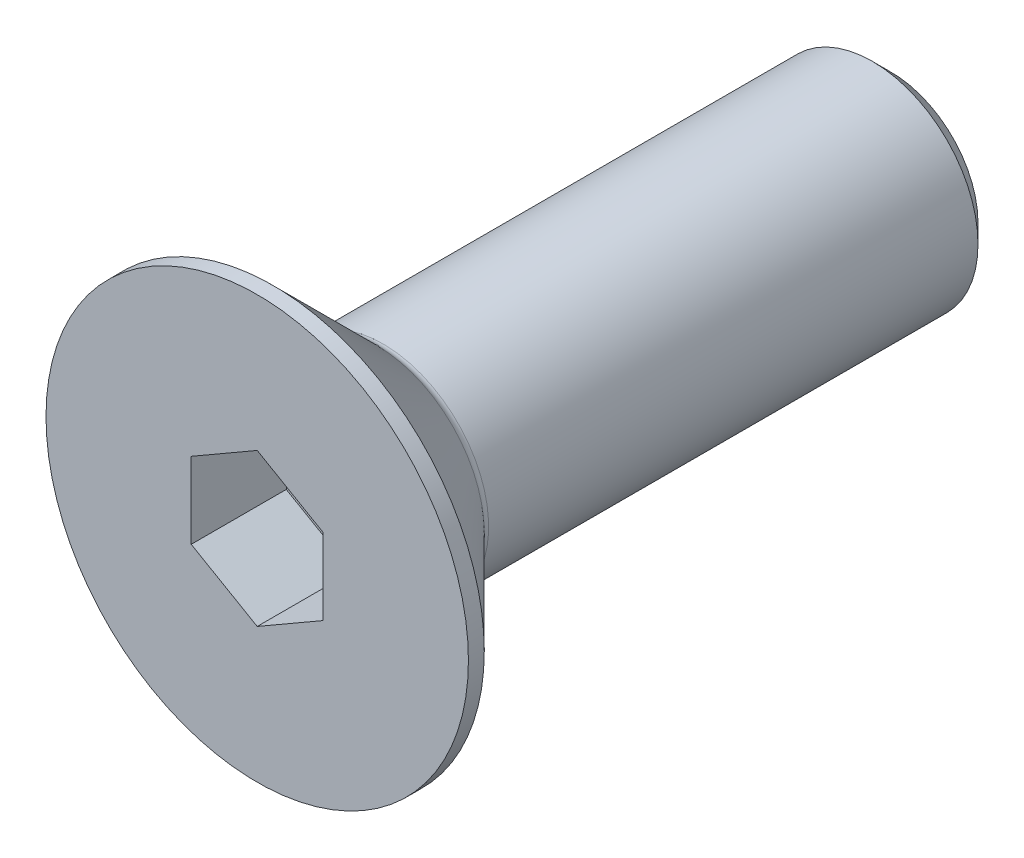
ISO-10303-21;
HEADER;
FILE_DESCRIPTION(('STEP AP214'),'2;1');
FILE_NAME('part.step','',(''),(''),'','','');
FILE_SCHEMA(('AUTOMOTIVE_DESIGN { 1 0 10303 214 1 1 1 1 }'));
ENDSEC;
DATA;
#1=APPLICATION_CONTEXT('core data for automotive mechanical design processes');
#2=APPLICATION_PROTOCOL_DEFINITION('international standard','automotive_design',2000,#1);
#3=PRODUCT_CONTEXT('',#1,'mechanical');
#4=PRODUCT('Part','Part','',(#3));
#5=PRODUCT_RELATED_PRODUCT_CATEGORY('part','',(#4));
#6=PRODUCT_DEFINITION_FORMATION('','',#4);
#7=PRODUCT_DEFINITION_CONTEXT('part definition',#1,'design');
#8=PRODUCT_DEFINITION('design','',#6,#7);
#9=PRODUCT_DEFINITION_SHAPE('','',#8);
#10=(LENGTH_UNIT() NAMED_UNIT(*) SI_UNIT(.MILLI.,.METRE.));
#11=(NAMED_UNIT(*) PLANE_ANGLE_UNIT() SI_UNIT($,.RADIAN.));
#12=(NAMED_UNIT(*) SI_UNIT($,.STERADIAN.) SOLID_ANGLE_UNIT());
#13=UNCERTAINTY_MEASURE_WITH_UNIT(LENGTH_MEASURE(1.E-05),#10,'distance_accuracy_value','');
#14=(GEOMETRIC_REPRESENTATION_CONTEXT(3) GLOBAL_UNCERTAINTY_ASSIGNED_CONTEXT((#13)) GLOBAL_UNIT_ASSIGNED_CONTEXT((#10,
#11,#12)) REPRESENTATION_CONTEXT('',''));
#15=CARTESIAN_POINT('',(0.,0.,0.));
#16=DIRECTION('',(0.,0.,1.));
#17=DIRECTION('',(1.,0.,0.));
#18=AXIS2_PLACEMENT_3D('',#15,#16,#17);
#19=CARTESIAN_POINT('',(0.,1.44337567297406,0.));
#20=DIRECTION('',(-0.5,0.866025403784439,0.));
#21=DIRECTION('',(-0.866025403784439,-0.5,0.));
#22=AXIS2_PLACEMENT_3D('',#19,#20,#21);
#23=PLANE('',#22);
#24=DIRECTION('',(0.,0.,1.));
#25=VECTOR('',#24,1.);
#26=CARTESIAN_POINT('',(0.,1.44337567297406,0.));
#27=LINE('',#26,#25);
#28=CARTESIAN_POINT('',(0.,1.44337567297406,-1.8));
#29=VERTEX_POINT('',#28);
#30=CARTESIAN_POINT('',(0.,1.44337567297406,0.));
#31=VERTEX_POINT('',#30);
#32=EDGE_CURVE('E82',#29,#31,#27,.T.);
#33=ORIENTED_EDGE('',*,*,#32,.T.);
#34=DIRECTION('',(-0.866025403784439,-0.5,0.));
#35=VECTOR('',#34,1.);
#36=CARTESIAN_POINT('',(0.,1.44337567297406,0.));
#37=LINE('',#36,#35);
#38=CARTESIAN_POINT('',(-1.25,0.721687836487033,0.));
#39=VERTEX_POINT('',#38);
#40=EDGE_CURVE('E71',#39,#31,#37,.F.);
#41=ORIENTED_EDGE('',*,*,#40,.F.);
#42=DIRECTION('',(0.,0.,1.));
#43=VECTOR('',#42,1.);
#44=CARTESIAN_POINT('',(-1.25,0.721687836487033,0.));
#45=LINE('',#44,#43);
#46=CARTESIAN_POINT('',(-1.25,0.721687836487033,-1.8));
#47=VERTEX_POINT('',#46);
#48=EDGE_CURVE('E138',#39,#47,#45,.F.);
#49=ORIENTED_EDGE('',*,*,#48,.T.);
#50=DIRECTION('',(-0.866025403784439,-0.5,0.));
#51=VECTOR('',#50,1.);
#52=CARTESIAN_POINT('',(0.,1.44337567297406,-1.8));
#53=LINE('',#52,#51);
#54=EDGE_CURVE('E67',#29,#47,#53,.T.);
#55=ORIENTED_EDGE('',*,*,#54,.F.);
#56=EDGE_LOOP('',(#33,#41,#49,#55));
#57=FACE_BOUND('',#56,.T.);
#58=ADVANCED_FACE('F16',(#57),#23,.F.);
#59=CARTESIAN_POINT('',(1.25,0.721687836487033,0.));
#60=DIRECTION('',(0.499999999999999,0.866025403784439,0.));
#61=DIRECTION('',(-0.866025403784439,0.499999999999999,0.));
#62=AXIS2_PLACEMENT_3D('',#59,#60,#61);
#63=PLANE('',#62);
#64=DIRECTION('',(0.,0.,-1.));
#65=VECTOR('',#64,1.);
#66=CARTESIAN_POINT('',(1.25,0.721687836487033,0.));
#67=LINE('',#66,#65);
#68=CARTESIAN_POINT('',(1.25,0.721687836487033,-1.8));
#69=VERTEX_POINT('',#68);
#70=CARTESIAN_POINT('',(1.25,0.721687836487033,0.));
#71=VERTEX_POINT('',#70);
#72=EDGE_CURVE('E87',#69,#71,#67,.F.);
#73=ORIENTED_EDGE('',*,*,#72,.T.);
#74=DIRECTION('',(-0.866025403784439,0.499999999999999,0.));
#75=VECTOR('',#74,1.);
#76=CARTESIAN_POINT('',(1.25,0.721687836487033,0.));
#77=LINE('',#76,#75);
#78=EDGE_CURVE('E75',#31,#71,#77,.F.);
#79=ORIENTED_EDGE('',*,*,#78,.F.);
#80=ORIENTED_EDGE('',*,*,#32,.F.);
#81=DIRECTION('',(-0.866025403784439,0.499999999999999,0.));
#82=VECTOR('',#81,1.);
#83=CARTESIAN_POINT('',(1.25,0.721687836487033,-1.8));
#84=LINE('',#83,#82);
#85=EDGE_CURVE('E88',#69,#29,#84,.T.);
#86=ORIENTED_EDGE('',*,*,#85,.F.);
#87=EDGE_LOOP('',(#73,#79,#80,#86));
#88=FACE_BOUND('',#87,.T.);
#89=ADVANCED_FACE('F85',(#88),#63,.F.);
#90=CARTESIAN_POINT('',(-1.25,0.721687836487033,0.));
#91=DIRECTION('',(-1.,0.,0.));
#92=DIRECTION('',(0.,0.,1.));
#93=AXIS2_PLACEMENT_3D('',#90,#91,#92);
#94=PLANE('',#93);
#95=ORIENTED_EDGE('',*,*,#48,.F.);
#96=DIRECTION('',(0.,1.,0.));
#97=VECTOR('',#96,1.);
#98=CARTESIAN_POINT('',(-1.25,0.721687836487033,0.));
#99=LINE('',#98,#97);
#100=CARTESIAN_POINT('',(-1.25,-0.721687836487033,0.));
#101=VERTEX_POINT('',#100);
#102=EDGE_CURVE('E78',#101,#39,#99,.T.);
#103=ORIENTED_EDGE('',*,*,#102,.F.);
#104=DIRECTION('',(0.,0.,1.));
#105=VECTOR('',#104,1.);
#106=CARTESIAN_POINT('',(-1.25,-0.721687836487033,0.));
#107=LINE('',#106,#105);
#108=CARTESIAN_POINT('',(-1.25,-0.721687836487033,-1.8));
#109=VERTEX_POINT('',#108);
#110=EDGE_CURVE('E129',#101,#109,#107,.F.);
#111=ORIENTED_EDGE('',*,*,#110,.T.);
#112=DIRECTION('',(0.,1.,0.));
#113=VECTOR('',#112,1.);
#114=CARTESIAN_POINT('',(-1.25,0.721687836487033,-1.8));
#115=LINE('',#114,#113);
#116=EDGE_CURVE('E136',#47,#109,#115,.F.);
#117=ORIENTED_EDGE('',*,*,#116,.F.);
#118=EDGE_LOOP('',(#95,#103,#111,#117));
#119=FACE_BOUND('',#118,.T.);
#120=ADVANCED_FACE('F141',(#119),#94,.F.);
#121=CARTESIAN_POINT('',(1.25,-0.721687836487033,0.));
#122=DIRECTION('',(1.,0.,0.));
#123=DIRECTION('',(0.,0.,-1.));
#124=AXIS2_PLACEMENT_3D('',#121,#122,#123);
#125=PLANE('',#124);
#126=DIRECTION('',(0.,0.,1.));
#127=VECTOR('',#126,1.);
#128=CARTESIAN_POINT('',(1.25,-0.721687836487032,0.));
#129=LINE('',#128,#127);
#130=CARTESIAN_POINT('',(1.25,-0.721687836487033,-1.8));
#131=VERTEX_POINT('',#130);
#132=CARTESIAN_POINT('',(1.25,-0.721687836487033,0.));
#133=VERTEX_POINT('',#132);
#134=EDGE_CURVE('E121',#131,#133,#129,.T.);
#135=ORIENTED_EDGE('',*,*,#134,.T.);
#136=DIRECTION('',(0.,1.,0.));
#137=VECTOR('',#136,1.);
#138=CARTESIAN_POINT('',(1.25,-0.721687836487033,0.));
#139=LINE('',#138,#137);
#140=EDGE_CURVE('E35',#71,#133,#139,.F.);
#141=ORIENTED_EDGE('',*,*,#140,.F.);
#142=ORIENTED_EDGE('',*,*,#72,.F.);
#143=DIRECTION('',(0.,1.,0.));
#144=VECTOR('',#143,1.);
#145=CARTESIAN_POINT('',(1.25,0.,-1.8));
#146=LINE('',#145,#144);
#147=EDGE_CURVE('E123',#131,#69,#146,.T.);
#148=ORIENTED_EDGE('',*,*,#147,.F.);
#149=EDGE_LOOP('',(#135,#141,#142,#148));
#150=FACE_BOUND('',#149,.T.);
#151=ADVANCED_FACE('F148',(#150),#125,.F.);
#152=CARTESIAN_POINT('',(-1.25,-0.721687836487033,0.));
#153=DIRECTION('',(-0.499999999999999,-0.866025403784439,0.));
#154=DIRECTION('',(0.866025403784439,-0.499999999999999,0.));
#155=AXIS2_PLACEMENT_3D('',#152,#153,#154);
#156=PLANE('',#155);
#157=ORIENTED_EDGE('',*,*,#110,.F.);
#158=DIRECTION('',(0.866025403784439,-0.499999999999999,0.));
#159=VECTOR('',#158,1.);
#160=CARTESIAN_POINT('',(-1.25,-0.721687836487033,0.));
#161=LINE('',#160,#159);
#162=CARTESIAN_POINT('',(0.,-1.44337567297406,0.));
#163=VERTEX_POINT('',#162);
#164=EDGE_CURVE('E132',#163,#101,#161,.F.);
#165=ORIENTED_EDGE('',*,*,#164,.F.);
#166=DIRECTION('',(0.,0.,1.));
#167=VECTOR('',#166,1.);
#168=CARTESIAN_POINT('',(0.,-1.44337567297406,0.));
#169=LINE('',#168,#167);
#170=CARTESIAN_POINT('',(0.,-1.44337567297406,-1.8));
#171=VERTEX_POINT('',#170);
#172=EDGE_CURVE('E119',#163,#171,#169,.F.);
#173=ORIENTED_EDGE('',*,*,#172,.T.);
#174=DIRECTION('',(0.866025403784439,-0.499999999999999,0.));
#175=VECTOR('',#174,1.);
#176=CARTESIAN_POINT('',(-1.25,-0.721687836487033,-1.8));
#177=LINE('',#176,#175);
#178=EDGE_CURVE('E126',#109,#171,#177,.T.);
#179=ORIENTED_EDGE('',*,*,#178,.F.);
#180=EDGE_LOOP('',(#157,#165,#173,#179));
#181=FACE_BOUND('',#180,.T.);
#182=ADVANCED_FACE('F155',(#181),#156,.F.);
#183=CARTESIAN_POINT('',(0.,0.,-1.8));
#184=DIRECTION('',(0.,0.,1.));
#185=DIRECTION('',(1.,0.,0.));
#186=AXIS2_PLACEMENT_3D('',#183,#184,#185);
#187=PLANE('',#186);
#188=ORIENTED_EDGE('',*,*,#54,.T.);
#189=ORIENTED_EDGE('',*,*,#116,.T.);
#190=ORIENTED_EDGE('',*,*,#178,.T.);
#191=DIRECTION('',(0.866025403784439,0.5,0.));
#192=VECTOR('',#191,1.);
#193=CARTESIAN_POINT('',(0.,-1.44337567297406,-1.8));
#194=LINE('',#193,#192);
#195=EDGE_CURVE('E116',#171,#131,#194,.T.);
#196=ORIENTED_EDGE('',*,*,#195,.T.);
#197=ORIENTED_EDGE('',*,*,#147,.T.);
#198=ORIENTED_EDGE('',*,*,#85,.T.);
#199=EDGE_LOOP('',(#188,#189,#190,#196,#197,#198));
#200=FACE_BOUND('',#199,.T.);
#201=ADVANCED_FACE('F145',(#200),#187,.T.);
#202=CARTESIAN_POINT('',(0.,-1.44337567297406,0.));
#203=DIRECTION('',(0.5,-0.866025403784439,0.));
#204=DIRECTION('',(0.866025403784439,0.5,0.));
#205=AXIS2_PLACEMENT_3D('',#202,#203,#204);
#206=PLANE('',#205);
#207=ORIENTED_EDGE('',*,*,#172,.F.);
#208=DIRECTION('',(-0.866025403784439,-0.499999999999999,0.));
#209=VECTOR('',#208,1.);
#210=CARTESIAN_POINT('',(1.25,-0.721687836487033,0.));
#211=LINE('',#210,#209);
#212=EDGE_CURVE('E114',#133,#163,#211,.T.);
#213=ORIENTED_EDGE('',*,*,#212,.F.);
#214=ORIENTED_EDGE('',*,*,#134,.F.);
#215=ORIENTED_EDGE('',*,*,#195,.F.);
#216=EDGE_LOOP('',(#207,#213,#214,#215));
#217=FACE_BOUND('',#216,.T.);
#218=ADVANCED_FACE('F153',(#217),#206,.F.);
#219=CARTESIAN_POINT('',(2.,0.,0.));
#220=DIRECTION('',(0.,0.,1.));
#221=DIRECTION('',(1.,0.,0.));
#222=AXIS2_PLACEMENT_3D('',#219,#220,#221);
#223=PLANE('',#222);
#224=ORIENTED_EDGE('',*,*,#140,.T.);
#225=ORIENTED_EDGE('',*,*,#212,.T.);
#226=ORIENTED_EDGE('',*,*,#164,.T.);
#227=ORIENTED_EDGE('',*,*,#102,.T.);
#228=ORIENTED_EDGE('',*,*,#40,.T.);
#229=ORIENTED_EDGE('',*,*,#78,.T.);
#230=EDGE_LOOP('',(#224,#225,#226,#227,#228,#229));
#231=FACE_BOUND('',#230,.T.);
#232=CARTESIAN_POINT('',(0.,0.,0.));
#233=DIRECTION('',(0.,0.,-1.));
#234=DIRECTION('',(-1.,0.,0.));
#235=AXIS2_PLACEMENT_3D('',#232,#233,#234);
#236=CIRCLE('',#235,4.);
#237=CARTESIAN_POINT('',(-4.,0.,0.));
#238=VERTEX_POINT('',#237);
#239=EDGE_CURVE('E20',#238,#238,#236,.T.);
#240=ORIENTED_EDGE('',*,*,#239,.F.);
#241=EDGE_LOOP('',(#240));
#242=FACE_BOUND('',#241,.T.);
#243=ADVANCED_FACE('F72',(#231,#242),#223,.T.);
#244=CARTESIAN_POINT('',(0.,0.,-0.150000000000001));
#245=DIRECTION('',(0.,0.,-1.));
#246=DIRECTION('',(-1.,0.,0.));
#247=AXIS2_PLACEMENT_3D('',#244,#245,#246);
#248=CYLINDRICAL_SURFACE('',#247,4.);
#249=ORIENTED_EDGE('',*,*,#239,.T.);
#250=EDGE_LOOP('',(#249));
#251=FACE_BOUND('',#250,.T.);
#252=CARTESIAN_POINT('',(0.,0.,-0.299999999128886));
#253=DIRECTION('',(0.,0.,1.));
#254=DIRECTION('',(1.,0.,0.));
#255=AXIS2_PLACEMENT_3D('',#252,#253,#254);
#256=CIRCLE('',#255,3.9999999991096);
#257=CARTESIAN_POINT('',(3.9999999991096,0.,-0.299999999128886));
#258=VERTEX_POINT('',#257);
#259=EDGE_CURVE('E101',#258,#258,#256,.F.);
#260=ORIENTED_EDGE('',*,*,#259,.F.);
#261=EDGE_LOOP('',(#260));
#262=FACE_BOUND('',#261,.T.);
#263=ADVANCED_FACE('F184',(#251,#262),#248,.T.);
#264=CARTESIAN_POINT('',(0.,0.,-0.299999999185729));
#265=DIRECTION('',(0.,0.,1.));
#266=DIRECTION('',(1.,0.,0.));
#267=AXIS2_PLACEMENT_3D('',#264,#265,#266);
#268=CONICAL_SURFACE('',#267,3.99999999905276,0.78539816250443);
#269=CARTESIAN_POINT('',(0.,0.,-2.24142135623731));
#270=DIRECTION('',(0.,0.,-1.));
#271=DIRECTION('',(-1.,0.,0.));
#272=AXIS2_PLACEMENT_3D('',#269,#270,#271);
#273=CIRCLE('',#272,2.05857864376269);
#274=CARTESIAN_POINT('',(-2.05857864376269,0.,-2.24142135623731));
#275=VERTEX_POINT('',#274);
#276=EDGE_CURVE('E95',#275,#275,#273,.T.);
#277=ORIENTED_EDGE('',*,*,#276,.F.);
#278=EDGE_LOOP('',(#277));
#279=FACE_BOUND('',#278,.T.);
#280=ORIENTED_EDGE('',*,*,#259,.T.);
#281=EDGE_LOOP('',(#280));
#282=FACE_BOUND('',#281,.T.);
#283=ADVANCED_FACE('F180',(#279,#282),#268,.T.);
#284=CARTESIAN_POINT('',(1.,0.,-12.));
#285=DIRECTION('',(0.,0.,-1.));
#286=DIRECTION('',(-1.,0.,0.));
#287=AXIS2_PLACEMENT_3D('',#284,#285,#286);
#288=PLANE('',#287);
#289=CARTESIAN_POINT('',(0.,0.,-12.000000000171));
#290=DIRECTION('',(0.,0.,1.));
#291=DIRECTION('',(1.,0.,0.));
#292=AXIS2_PLACEMENT_3D('',#289,#290,#291);
#293=CIRCLE('',#292,1.65000000015425);
#294=CARTESIAN_POINT('',(1.65000000015425,0.,-12.000000000171));
#295=VERTEX_POINT('',#294);
#296=EDGE_CURVE('E93',#295,#295,#293,.T.);
#297=ORIENTED_EDGE('',*,*,#296,.F.);
#298=EDGE_LOOP('',(#297));
#299=FACE_BOUND('',#298,.T.);
#300=ADVANCED_FACE('F177',(#299),#288,.T.);
#301=CARTESIAN_POINT('',(0.,0.,-2.38284271247462));
#302=DIRECTION('',(0.,0.,-1.));
#303=DIRECTION('',(0.,1.,0.));
#304=AXIS2_PLACEMENT_3D('',#301,#302,#303);
#305=TOROIDAL_SURFACE('',#304,2.2,0.2);
#306=CARTESIAN_POINT('',(0.,0.,-2.38284271247462));
#307=DIRECTION('',(0.,0.,-1.));
#308=DIRECTION('',(-1.,0.,0.));
#309=AXIS2_PLACEMENT_3D('',#306,#307,#308);
#310=CIRCLE('',#309,2.);
#311=CARTESIAN_POINT('',(-2.,0.,-2.38284271247462));
#312=VERTEX_POINT('',#311);
#313=EDGE_CURVE('E26',#312,#312,#310,.T.);
#314=ORIENTED_EDGE('',*,*,#313,.F.);
#315=EDGE_LOOP('',(#314));
#316=FACE_BOUND('',#315,.T.);
#317=ORIENTED_EDGE('',*,*,#276,.T.);
#318=EDGE_LOOP('',(#317));
#319=FACE_BOUND('',#318,.T.);
#320=ADVANCED_FACE('F18',(#316,#319),#305,.F.);
#321=CARTESIAN_POINT('',(0.,0.,-11.6499999998041));
#322=DIRECTION('',(0.,0.,1.));
#323=DIRECTION('',(1.,0.,0.));
#324=AXIS2_PLACEMENT_3D('',#321,#322,#323);
#325=CONICAL_SURFACE('',#324,1.99999999989586,0.785398162504195);
#326=ORIENTED_EDGE('',*,*,#296,.T.);
#327=EDGE_LOOP('',(#326));
#328=FACE_BOUND('',#327,.T.);
#329=CARTESIAN_POINT('',(0.,0.,-11.65));
#330=DIRECTION('',(0.,0.,-1.));
#331=DIRECTION('',(-1.,0.,0.));
#332=AXIS2_PLACEMENT_3D('',#329,#330,#331);
#333=CIRCLE('',#332,2.);
#334=CARTESIAN_POINT('',(-2.,0.,-11.65));
#335=VERTEX_POINT('',#334);
#336=EDGE_CURVE('E10',#335,#335,#333,.F.);
#337=ORIENTED_EDGE('',*,*,#336,.F.);
#338=EDGE_LOOP('',(#337));
#339=FACE_BOUND('',#338,.T.);
#340=ADVANCED_FACE('F167',(#328,#339),#325,.T.);
#341=CARTESIAN_POINT('',(0.,0.,-7.15));
#342=DIRECTION('',(0.,0.,-1.));
#343=DIRECTION('',(-1.,0.,0.));
#344=AXIS2_PLACEMENT_3D('',#341,#342,#343);
#345=CYLINDRICAL_SURFACE('',#344,2.);
#346=ORIENTED_EDGE('',*,*,#336,.T.);
#347=EDGE_LOOP('',(#346));
#348=FACE_BOUND('',#347,.T.);
#349=ORIENTED_EDGE('',*,*,#313,.T.);
#350=EDGE_LOOP('',(#349));
#351=FACE_BOUND('',#350,.T.);
#352=ADVANCED_FACE('F165',(#348,#351),#345,.T.);
#353=CLOSED_SHELL('',(#58,#89,#120,#151,#182,#201,#218,#243,#263,#283,#300,#320,#340,#352));
#354=MANIFOLD_SOLID_BREP('B1',#353);
#355=ADVANCED_BREP_SHAPE_REPRESENTATION('',(#18,#354),#14);
#356=SHAPE_DEFINITION_REPRESENTATION(#9,#355);
ENDSEC;
END-ISO-10303-21;
